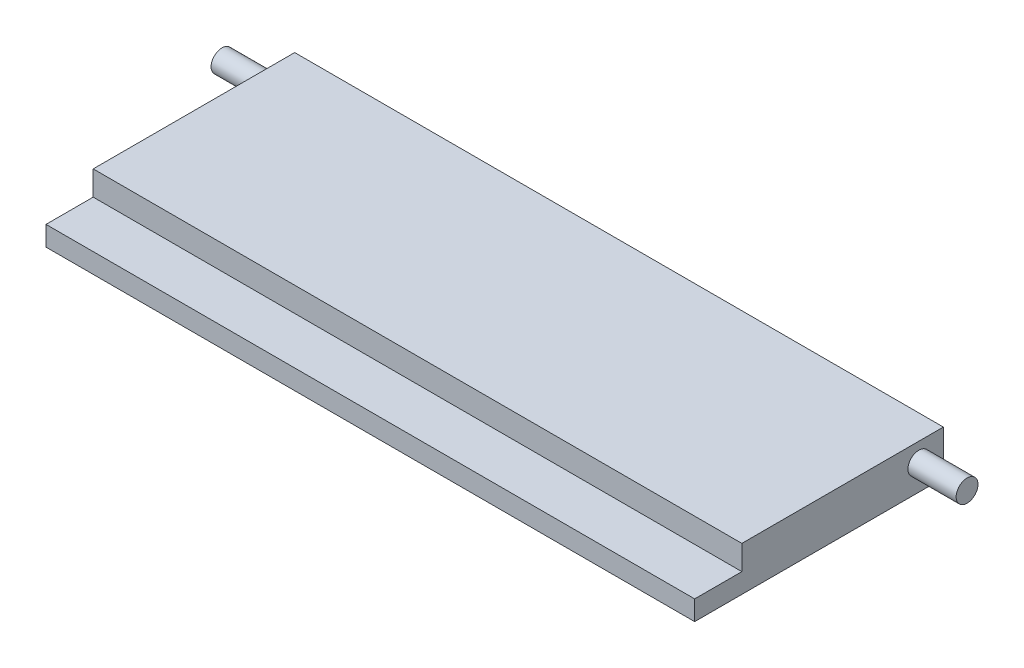
ISO-10303-21;
HEADER;
FILE_DESCRIPTION(('STEP AP214'),'2;1');
FILE_NAME('part.step','',(''),(''),'','','');
FILE_SCHEMA(('AUTOMOTIVE_DESIGN { 1 0 10303 214 1 1 1 1 }'));
ENDSEC;
DATA;
#1=APPLICATION_CONTEXT('core data for automotive mechanical design processes');
#2=APPLICATION_PROTOCOL_DEFINITION('international standard','automotive_design',2000,#1);
#3=PRODUCT_CONTEXT('',#1,'mechanical');
#4=PRODUCT('Part','Part','',(#3));
#5=PRODUCT_RELATED_PRODUCT_CATEGORY('part','',(#4));
#6=PRODUCT_DEFINITION_FORMATION('','',#4);
#7=PRODUCT_DEFINITION_CONTEXT('part definition',#1,'design');
#8=PRODUCT_DEFINITION('design','',#6,#7);
#9=PRODUCT_DEFINITION_SHAPE('','',#8);
#10=(LENGTH_UNIT() NAMED_UNIT(*) SI_UNIT(.MILLI.,.METRE.));
#11=(NAMED_UNIT(*) PLANE_ANGLE_UNIT() SI_UNIT($,.RADIAN.));
#12=(NAMED_UNIT(*) SI_UNIT($,.STERADIAN.) SOLID_ANGLE_UNIT());
#13=UNCERTAINTY_MEASURE_WITH_UNIT(LENGTH_MEASURE(1.E-05),#10,'distance_accuracy_value','');
#14=(GEOMETRIC_REPRESENTATION_CONTEXT(3) GLOBAL_UNCERTAINTY_ASSIGNED_CONTEXT((#13)) GLOBAL_UNIT_ASSIGNED_CONTEXT((#10,
#11,#12)) REPRESENTATION_CONTEXT('',''));
#15=CARTESIAN_POINT('',(0.,0.,0.));
#16=DIRECTION('',(0.,0.,1.));
#17=DIRECTION('',(1.,0.,0.));
#18=AXIS2_PLACEMENT_3D('',#15,#16,#17);
#19=CARTESIAN_POINT('',(0.,0.,20.4978));
#20=DIRECTION('',(0.,0.,-1.));
#21=DIRECTION('',(-1.,0.,0.));
#22=AXIS2_PLACEMENT_3D('',#19,#20,#21);
#23=PLANE('',#22);
#24=DIRECTION('',(-1.,0.,0.));
#25=VECTOR('',#24,1.);
#26=CARTESIAN_POINT('',(-32.9946,-0.2413,20.4978));
#27=LINE('',#26,#25);
#28=CARTESIAN_POINT('',(32.9946,-0.2413,20.4978));
#29=VERTEX_POINT('',#28);
#30=CARTESIAN_POINT('',(-32.9946,-0.2413,20.4978));
#31=VERTEX_POINT('',#30);
#32=EDGE_CURVE('E59',#29,#31,#27,.T.);
#33=ORIENTED_EDGE('',*,*,#32,.F.);
#34=DIRECTION('',(0.,1.,0.));
#35=VECTOR('',#34,1.);
#36=CARTESIAN_POINT('',(32.9946,-2.2479,20.4978));
#37=LINE('',#36,#35);
#38=CARTESIAN_POINT('',(32.9946,2.2479,20.4978));
#39=VERTEX_POINT('',#38);
#40=EDGE_CURVE('E98',#29,#39,#37,.T.);
#41=ORIENTED_EDGE('',*,*,#40,.T.);
#42=DIRECTION('',(-1.,0.,0.));
#43=VECTOR('',#42,1.);
#44=CARTESIAN_POINT('',(-32.9946,2.2479,20.4978));
#45=LINE('',#44,#43);
#46=CARTESIAN_POINT('',(-32.9946,2.2479,20.4978));
#47=VERTEX_POINT('',#46);
#48=EDGE_CURVE('E65',#39,#47,#45,.T.);
#49=ORIENTED_EDGE('',*,*,#48,.T.);
#50=DIRECTION('',(0.,-1.,0.));
#51=VECTOR('',#50,1.);
#52=CARTESIAN_POINT('',(-32.9946,-2.2479,20.4978));
#53=LINE('',#52,#51);
#54=EDGE_CURVE('E110',#47,#31,#53,.T.);
#55=ORIENTED_EDGE('',*,*,#54,.T.);
#56=EDGE_LOOP('',(#33,#41,#49,#55));
#57=FACE_BOUND('',#56,.T.);
#58=ADVANCED_FACE('F42',(#57),#23,.F.);
#59=CARTESIAN_POINT('',(32.9946,-2.2479,20.4978));
#60=DIRECTION('',(-1.,0.,0.));
#61=DIRECTION('',(0.,0.,1.));
#62=AXIS2_PLACEMENT_3D('',#59,#60,#61);
#63=PLANE('',#62);
#64=CARTESIAN_POINT('',(32.9946,0.3429,2.4892));
#65=DIRECTION('',(-1.,0.,0.));
#66=DIRECTION('',(0.,0.,1.));
#67=AXIS2_PLACEMENT_3D('',#64,#65,#66);
#68=CIRCLE('',#67,1.11252);
#69=CARTESIAN_POINT('',(32.9946,0.3429,3.60172));
#70=VERTEX_POINT('',#69);
#71=EDGE_CURVE('E11',#70,#70,#68,.F.);
#72=ORIENTED_EDGE('',*,*,#71,.F.);
#73=EDGE_LOOP('',(#72));
#74=FACE_BOUND('',#73,.T.);
#75=DIRECTION('',(0.,1.,0.));
#76=VECTOR('',#75,1.);
#77=CARTESIAN_POINT('',(32.9946,-2.2479,0.));
#78=LINE('',#77,#76);
#79=CARTESIAN_POINT('',(32.9946,-2.2479,0.));
#80=VERTEX_POINT('',#79);
#81=CARTESIAN_POINT('',(32.9946,2.2479,0.));
#82=VERTEX_POINT('',#81);
#83=EDGE_CURVE('E105',#80,#82,#78,.T.);
#84=ORIENTED_EDGE('',*,*,#83,.T.);
#85=DIRECTION('',(0.,0.,-1.));
#86=VECTOR('',#85,1.);
#87=CARTESIAN_POINT('',(32.9946,2.2479,20.4978));
#88=LINE('',#87,#86);
#89=EDGE_CURVE('E135',#39,#82,#88,.T.);
#90=ORIENTED_EDGE('',*,*,#89,.F.);
#91=ORIENTED_EDGE('',*,*,#40,.F.);
#92=DIRECTION('',(0.,0.,-1.));
#93=VECTOR('',#92,1.);
#94=CARTESIAN_POINT('',(32.9946,-0.2413,25.2984));
#95=LINE('',#94,#93);
#96=CARTESIAN_POINT('',(32.9946,-0.2413,25.2984));
#97=VERTEX_POINT('',#96);
#98=EDGE_CURVE('E116',#97,#29,#95,.T.);
#99=ORIENTED_EDGE('',*,*,#98,.F.);
#100=DIRECTION('',(0.,1.,0.));
#101=VECTOR('',#100,1.);
#102=CARTESIAN_POINT('',(32.9946,-0.2413,25.2984));
#103=LINE('',#102,#101);
#104=CARTESIAN_POINT('',(32.9946,-2.2479,25.2984));
#105=VERTEX_POINT('',#104);
#106=EDGE_CURVE('E108',#105,#97,#103,.T.);
#107=ORIENTED_EDGE('',*,*,#106,.F.);
#108=DIRECTION('',(0.,0.,-1.));
#109=VECTOR('',#108,1.);
#110=CARTESIAN_POINT('',(32.9946,-2.2479,20.4978));
#111=LINE('',#110,#109);
#112=EDGE_CURVE('E90',#105,#80,#111,.T.);
#113=ORIENTED_EDGE('',*,*,#112,.T.);
#114=EDGE_LOOP('',(#84,#90,#91,#99,#107,#113));
#115=FACE_BOUND('',#114,.T.);
#116=ADVANCED_FACE('F44',(#74,#115),#63,.F.);
#117=CARTESIAN_POINT('',(-32.9946,2.2479,20.4978));
#118=DIRECTION('',(0.,-1.,0.));
#119=DIRECTION('',(0.,0.,-1.));
#120=AXIS2_PLACEMENT_3D('',#117,#118,#119);
#121=PLANE('',#120);
#122=DIRECTION('',(-1.,0.,0.));
#123=VECTOR('',#122,1.);
#124=CARTESIAN_POINT('',(-32.9946,2.2479,0.));
#125=LINE('',#124,#123);
#126=CARTESIAN_POINT('',(-32.9946,2.2479,0.));
#127=VERTEX_POINT('',#126);
#128=EDGE_CURVE('E113',#82,#127,#125,.T.);
#129=ORIENTED_EDGE('',*,*,#128,.T.);
#130=DIRECTION('',(0.,0.,-1.));
#131=VECTOR('',#130,1.);
#132=CARTESIAN_POINT('',(-32.9946,2.2479,20.4978));
#133=LINE('',#132,#131);
#134=EDGE_CURVE('E132',#47,#127,#133,.T.);
#135=ORIENTED_EDGE('',*,*,#134,.F.);
#136=ORIENTED_EDGE('',*,*,#48,.F.);
#137=ORIENTED_EDGE('',*,*,#89,.T.);
#138=EDGE_LOOP('',(#129,#135,#136,#137));
#139=FACE_BOUND('',#138,.T.);
#140=ADVANCED_FACE('F149',(#139),#121,.F.);
#141=CARTESIAN_POINT('',(-32.9946,-2.2479,20.4978));
#142=DIRECTION('',(1.,0.,0.));
#143=DIRECTION('',(0.,0.,-1.));
#144=AXIS2_PLACEMENT_3D('',#141,#142,#143);
#145=PLANE('',#144);
#146=CARTESIAN_POINT('',(-32.9946,0.3429,2.4892));
#147=DIRECTION('',(1.,0.,0.));
#148=DIRECTION('',(0.,0.,-1.));
#149=AXIS2_PLACEMENT_3D('',#146,#147,#148);
#150=CIRCLE('',#149,1.11252);
#151=CARTESIAN_POINT('',(-32.9946,0.3429,1.37668));
#152=VERTEX_POINT('',#151);
#153=EDGE_CURVE('E46',#152,#152,#150,.F.);
#154=ORIENTED_EDGE('',*,*,#153,.F.);
#155=EDGE_LOOP('',(#154));
#156=FACE_BOUND('',#155,.T.);
#157=DIRECTION('',(0.,-1.,0.));
#158=VECTOR('',#157,1.);
#159=CARTESIAN_POINT('',(-32.9946,-2.2479,0.));
#160=LINE('',#159,#158);
#161=CARTESIAN_POINT('',(-32.9946,-2.2479,0.));
#162=VERTEX_POINT('',#161);
#163=EDGE_CURVE('E99',#127,#162,#160,.T.);
#164=ORIENTED_EDGE('',*,*,#163,.T.);
#165=DIRECTION('',(0.,0.,-1.));
#166=VECTOR('',#165,1.);
#167=CARTESIAN_POINT('',(-32.9946,-2.2479,20.4978));
#168=LINE('',#167,#166);
#169=CARTESIAN_POINT('',(-32.9946,-2.2479,25.2984));
#170=VERTEX_POINT('',#169);
#171=EDGE_CURVE('E93',#170,#162,#168,.T.);
#172=ORIENTED_EDGE('',*,*,#171,.F.);
#173=DIRECTION('',(0.,-1.,0.));
#174=VECTOR('',#173,1.);
#175=CARTESIAN_POINT('',(-32.9946,-0.2413,25.2984));
#176=LINE('',#175,#174);
#177=CARTESIAN_POINT('',(-32.9946,-0.2413,25.2984));
#178=VERTEX_POINT('',#177);
#179=EDGE_CURVE('E180',#178,#170,#176,.T.);
#180=ORIENTED_EDGE('',*,*,#179,.F.);
#181=DIRECTION('',(0.,0.,-1.));
#182=VECTOR('',#181,1.);
#183=CARTESIAN_POINT('',(-32.9946,-0.2413,25.2984));
#184=LINE('',#183,#182);
#185=EDGE_CURVE('E123',#178,#31,#184,.T.);
#186=ORIENTED_EDGE('',*,*,#185,.T.);
#187=ORIENTED_EDGE('',*,*,#54,.F.);
#188=ORIENTED_EDGE('',*,*,#134,.T.);
#189=EDGE_LOOP('',(#164,#172,#180,#186,#187,#188));
#190=FACE_BOUND('',#189,.T.);
#191=ADVANCED_FACE('F146',(#156,#190),#145,.F.);
#192=CARTESIAN_POINT('',(-32.9946,-2.2479,20.4978));
#193=DIRECTION('',(0.,1.,0.));
#194=DIRECTION('',(0.,0.,1.));
#195=AXIS2_PLACEMENT_3D('',#192,#193,#194);
#196=PLANE('',#195);
#197=DIRECTION('',(1.,0.,0.));
#198=VECTOR('',#197,1.);
#199=CARTESIAN_POINT('',(-32.9946,-2.2479,0.));
#200=LINE('',#199,#198);
#201=EDGE_CURVE('E85',#162,#80,#200,.T.);
#202=ORIENTED_EDGE('',*,*,#201,.T.);
#203=ORIENTED_EDGE('',*,*,#112,.F.);
#204=DIRECTION('',(1.,0.,0.));
#205=VECTOR('',#204,1.);
#206=CARTESIAN_POINT('',(-32.9946,-2.2479,25.2984));
#207=LINE('',#206,#205);
#208=EDGE_CURVE('E175',#170,#105,#207,.T.);
#209=ORIENTED_EDGE('',*,*,#208,.F.);
#210=ORIENTED_EDGE('',*,*,#171,.T.);
#211=EDGE_LOOP('',(#202,#203,#209,#210));
#212=FACE_BOUND('',#211,.T.);
#213=ADVANCED_FACE('F87',(#212),#196,.F.);
#214=CARTESIAN_POINT('',(0.,0.,0.));
#215=DIRECTION('',(0.,0.,-1.));
#216=DIRECTION('',(-1.,0.,0.));
#217=AXIS2_PLACEMENT_3D('',#214,#215,#216);
#218=PLANE('',#217);
#219=ORIENTED_EDGE('',*,*,#83,.F.);
#220=ORIENTED_EDGE('',*,*,#201,.F.);
#221=ORIENTED_EDGE('',*,*,#163,.F.);
#222=ORIENTED_EDGE('',*,*,#128,.F.);
#223=EDGE_LOOP('',(#219,#220,#221,#222));
#224=FACE_BOUND('',#223,.T.);
#225=ADVANCED_FACE('F112',(#224),#218,.T.);
#226=CARTESIAN_POINT('',(-32.9946,-0.2413,25.2984));
#227=DIRECTION('',(0.,-1.,0.));
#228=DIRECTION('',(0.,0.,-1.));
#229=AXIS2_PLACEMENT_3D('',#226,#227,#228);
#230=PLANE('',#229);
#231=ORIENTED_EDGE('',*,*,#32,.T.);
#232=ORIENTED_EDGE('',*,*,#185,.F.);
#233=DIRECTION('',(-1.,0.,0.));
#234=VECTOR('',#233,1.);
#235=CARTESIAN_POINT('',(-32.9946,-0.2413,25.2984));
#236=LINE('',#235,#234);
#237=EDGE_CURVE('E165',#97,#178,#236,.T.);
#238=ORIENTED_EDGE('',*,*,#237,.F.);
#239=ORIENTED_EDGE('',*,*,#98,.T.);
#240=EDGE_LOOP('',(#231,#232,#238,#239));
#241=FACE_BOUND('',#240,.T.);
#242=ADVANCED_FACE('F161',(#241),#230,.F.);
#243=CARTESIAN_POINT('',(0.,0.,25.2984));
#244=DIRECTION('',(0.,0.,1.));
#245=DIRECTION('',(1.,0.,0.));
#246=AXIS2_PLACEMENT_3D('',#243,#244,#245);
#247=PLANE('',#246);
#248=ORIENTED_EDGE('',*,*,#179,.T.);
#249=ORIENTED_EDGE('',*,*,#208,.T.);
#250=ORIENTED_EDGE('',*,*,#106,.T.);
#251=ORIENTED_EDGE('',*,*,#237,.T.);
#252=EDGE_LOOP('',(#248,#249,#250,#251));
#253=FACE_BOUND('',#252,.T.);
#254=ADVANCED_FACE('F197',(#253),#247,.T.);
#255=CARTESIAN_POINT('',(-37.8968,0.3429,2.4892));
#256=DIRECTION('',(1.,0.,0.));
#257=DIRECTION('',(0.,0.,-1.));
#258=AXIS2_PLACEMENT_3D('',#255,#256,#257);
#259=PLANE('',#258);
#260=CARTESIAN_POINT('',(-37.8968,0.3429,2.4892));
#261=DIRECTION('',(1.,0.,0.));
#262=DIRECTION('',(0.,0.,-1.));
#263=AXIS2_PLACEMENT_3D('',#260,#261,#262);
#264=CIRCLE('',#263,1.11252);
#265=CARTESIAN_POINT('',(-37.8968,0.3429,1.37668));
#266=VERTEX_POINT('',#265);
#267=EDGE_CURVE('E187',#266,#266,#264,.T.);
#268=ORIENTED_EDGE('',*,*,#267,.F.);
#269=EDGE_LOOP('',(#268));
#270=FACE_BOUND('',#269,.T.);
#271=ADVANCED_FACE('F251',(#270),#259,.F.);
#272=CARTESIAN_POINT('',(37.8968,0.3429,2.4892));
#273=DIRECTION('',(-1.,0.,0.));
#274=DIRECTION('',(0.,0.,1.));
#275=AXIS2_PLACEMENT_3D('',#272,#273,#274);
#276=CYLINDRICAL_SURFACE('',#275,1.11252);
#277=ORIENTED_EDGE('',*,*,#267,.T.);
#278=EDGE_LOOP('',(#277));
#279=FACE_BOUND('',#278,.T.);
#280=ORIENTED_EDGE('',*,*,#153,.T.);
#281=EDGE_LOOP('',(#280));
#282=FACE_BOUND('',#281,.T.);
#283=ADVANCED_FACE('F144',(#279,#282),#276,.T.);
#284=CARTESIAN_POINT('',(37.8968,0.3429,2.4892));
#285=DIRECTION('',(1.,0.,0.));
#286=DIRECTION('',(0.,0.,-1.));
#287=AXIS2_PLACEMENT_3D('',#284,#285,#286);
#288=CIRCLE('',#287,1.11252);
#289=CARTESIAN_POINT('',(37.8968,0.3429,1.37668));
#290=VERTEX_POINT('',#289);
#291=EDGE_CURVE('E181',#290,#290,#288,.T.);
#292=ORIENTED_EDGE('',*,*,#291,.F.);
#293=EDGE_LOOP('',(#292));
#294=FACE_BOUND('',#293,.T.);
#295=ORIENTED_EDGE('',*,*,#71,.T.);
#296=EDGE_LOOP('',(#295));
#297=FACE_BOUND('',#296,.T.);
#298=ADVANCED_FACE('F264',(#294,#297),#276,.T.);
#299=CARTESIAN_POINT('',(37.8968,0.3429,2.4892));
#300=DIRECTION('',(1.,0.,0.));
#301=DIRECTION('',(0.,0.,-1.));
#302=AXIS2_PLACEMENT_3D('',#299,#300,#301);
#303=PLANE('',#302);
#304=ORIENTED_EDGE('',*,*,#291,.T.);
#305=EDGE_LOOP('',(#304));
#306=FACE_BOUND('',#305,.T.);
#307=ADVANCED_FACE('F272',(#306),#303,.T.);
#308=CLOSED_SHELL('',(#58,#116,#140,#191,#213,#225,#242,#254,#271,#283,#298,#307));
#309=MANIFOLD_SOLID_BREP('B2',#308);
#310=ADVANCED_BREP_SHAPE_REPRESENTATION('',(#18,#309),#14);
#311=SHAPE_DEFINITION_REPRESENTATION(#9,#310);
ENDSEC;
END-ISO-10303-21;
